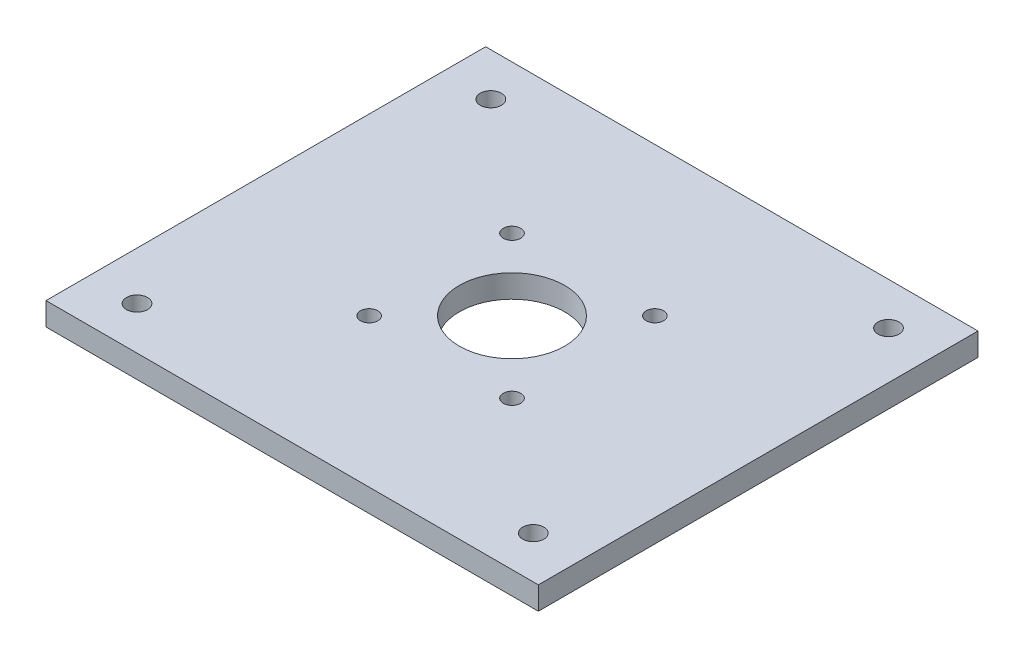
ISO-10303-21;
HEADER;
FILE_DESCRIPTION(('STEP AP214'),'2;1');
FILE_NAME('part.step','',(''),(''),'','','');
FILE_SCHEMA(('AUTOMOTIVE_DESIGN { 1 0 10303 214 1 1 1 1 }'));
ENDSEC;
DATA;
#1=APPLICATION_CONTEXT('core data for automotive mechanical design processes');
#2=APPLICATION_PROTOCOL_DEFINITION('international standard','automotive_design',2000,#1);
#3=PRODUCT_CONTEXT('',#1,'mechanical');
#4=PRODUCT('Part','Part','',(#3));
#5=PRODUCT_RELATED_PRODUCT_CATEGORY('part','',(#4));
#6=PRODUCT_DEFINITION_FORMATION('','',#4);
#7=PRODUCT_DEFINITION_CONTEXT('part definition',#1,'design');
#8=PRODUCT_DEFINITION('design','',#6,#7);
#9=PRODUCT_DEFINITION_SHAPE('','',#8);
#10=(LENGTH_UNIT() NAMED_UNIT(*) SI_UNIT(.MILLI.,.METRE.));
#11=(NAMED_UNIT(*) PLANE_ANGLE_UNIT() SI_UNIT($,.RADIAN.));
#12=(NAMED_UNIT(*) SI_UNIT($,.STERADIAN.) SOLID_ANGLE_UNIT());
#13=UNCERTAINTY_MEASURE_WITH_UNIT(LENGTH_MEASURE(1.E-05),#10,'distance_accuracy_value','');
#14=(GEOMETRIC_REPRESENTATION_CONTEXT(3) GLOBAL_UNCERTAINTY_ASSIGNED_CONTEXT((#13)) GLOBAL_UNIT_ASSIGNED_CONTEXT((#10,
#11,#12)) REPRESENTATION_CONTEXT('',''));
#15=CARTESIAN_POINT('',(0.,0.,0.));
#16=DIRECTION('',(0.,0.,1.));
#17=DIRECTION('',(1.,0.,0.));
#18=AXIS2_PLACEMENT_3D('',#15,#16,#17);
#19=CARTESIAN_POINT('',(-53.75,5.,48.));
#20=DIRECTION('',(0.,0.,-1.));
#21=DIRECTION('',(-1.,0.,0.));
#22=AXIS2_PLACEMENT_3D('',#19,#20,#21);
#23=PLANE('',#22);
#24=DIRECTION('',(1.,0.,0.));
#25=VECTOR('',#24,1.);
#26=CARTESIAN_POINT('',(-53.75,0.,48.));
#27=LINE('',#26,#25);
#28=CARTESIAN_POINT('',(-53.75,0.,48.));
#29=VERTEX_POINT('',#28);
#30=CARTESIAN_POINT('',(53.75,0.,48.));
#31=VERTEX_POINT('',#30);
#32=EDGE_CURVE('E95',#29,#31,#27,.T.);
#33=ORIENTED_EDGE('',*,*,#32,.T.);
#34=DIRECTION('',(0.,-1.,0.));
#35=VECTOR('',#34,1.);
#36=CARTESIAN_POINT('',(53.75,5.,48.));
#37=LINE('',#36,#35);
#38=CARTESIAN_POINT('',(53.75,5.,48.));
#39=VERTEX_POINT('',#38);
#40=EDGE_CURVE('E11',#39,#31,#37,.T.);
#41=ORIENTED_EDGE('',*,*,#40,.F.);
#42=DIRECTION('',(1.,0.,0.));
#43=VECTOR('',#42,1.);
#44=CARTESIAN_POINT('',(-53.75,5.,48.));
#45=LINE('',#44,#43);
#46=CARTESIAN_POINT('',(-53.75,5.,48.));
#47=VERTEX_POINT('',#46);
#48=EDGE_CURVE('E81',#47,#39,#45,.T.);
#49=ORIENTED_EDGE('',*,*,#48,.F.);
#50=DIRECTION('',(0.,-1.,0.));
#51=VECTOR('',#50,1.);
#52=CARTESIAN_POINT('',(-53.75,5.,48.));
#53=LINE('',#52,#51);
#54=EDGE_CURVE('E48',#47,#29,#53,.T.);
#55=ORIENTED_EDGE('',*,*,#54,.T.);
#56=EDGE_LOOP('',(#33,#41,#49,#55));
#57=FACE_BOUND('',#56,.T.);
#58=ADVANCED_FACE('F32',(#57),#23,.F.);
#59=CARTESIAN_POINT('',(53.75,5.,48.));
#60=DIRECTION('',(-1.,0.,0.));
#61=DIRECTION('',(0.,0.,1.));
#62=AXIS2_PLACEMENT_3D('',#59,#60,#61);
#63=PLANE('',#62);
#64=DIRECTION('',(0.,0.,-1.));
#65=VECTOR('',#64,1.);
#66=CARTESIAN_POINT('',(53.75,0.,48.));
#67=LINE('',#66,#65);
#68=CARTESIAN_POINT('',(53.75,0.,-48.));
#69=VERTEX_POINT('',#68);
#70=EDGE_CURVE('E86',#31,#69,#67,.T.);
#71=ORIENTED_EDGE('',*,*,#70,.T.);
#72=DIRECTION('',(0.,-1.,0.));
#73=VECTOR('',#72,1.);
#74=CARTESIAN_POINT('',(53.75,5.,-48.));
#75=LINE('',#74,#73);
#76=CARTESIAN_POINT('',(53.75,5.,-48.));
#77=VERTEX_POINT('',#76);
#78=EDGE_CURVE('E40',#77,#69,#75,.T.);
#79=ORIENTED_EDGE('',*,*,#78,.F.);
#80=DIRECTION('',(0.,0.,-1.));
#81=VECTOR('',#80,1.);
#82=CARTESIAN_POINT('',(53.75,5.,48.));
#83=LINE('',#82,#81);
#84=EDGE_CURVE('E73',#39,#77,#83,.T.);
#85=ORIENTED_EDGE('',*,*,#84,.F.);
#86=ORIENTED_EDGE('',*,*,#40,.T.);
#87=EDGE_LOOP('',(#71,#79,#85,#86));
#88=FACE_BOUND('',#87,.T.);
#89=ADVANCED_FACE('F85',(#88),#63,.F.);
#90=CARTESIAN_POINT('',(-53.75,5.,-48.));
#91=DIRECTION('',(0.,0.,-1.));
#92=DIRECTION('',(-1.,0.,0.));
#93=AXIS2_PLACEMENT_3D('',#90,#91,#92);
#94=PLANE('',#93);
#95=DIRECTION('',(1.,0.,0.));
#96=VECTOR('',#95,1.);
#97=CARTESIAN_POINT('',(-53.75,0.,-48.));
#98=LINE('',#97,#96);
#99=CARTESIAN_POINT('',(-53.75,0.,-48.));
#100=VERTEX_POINT('',#99);
#101=EDGE_CURVE('E99',#100,#69,#98,.T.);
#102=ORIENTED_EDGE('',*,*,#101,.F.);
#103=DIRECTION('',(0.,-1.,0.));
#104=VECTOR('',#103,1.);
#105=CARTESIAN_POINT('',(-53.75,5.,-48.));
#106=LINE('',#105,#104);
#107=CARTESIAN_POINT('',(-53.75,5.,-48.));
#108=VERTEX_POINT('',#107);
#109=EDGE_CURVE('E62',#108,#100,#106,.T.);
#110=ORIENTED_EDGE('',*,*,#109,.F.);
#111=DIRECTION('',(1.,0.,0.));
#112=VECTOR('',#111,1.);
#113=CARTESIAN_POINT('',(-53.75,5.,-48.));
#114=LINE('',#113,#112);
#115=EDGE_CURVE('E80',#108,#77,#114,.T.);
#116=ORIENTED_EDGE('',*,*,#115,.T.);
#117=ORIENTED_EDGE('',*,*,#78,.T.);
#118=EDGE_LOOP('',(#102,#110,#116,#117));
#119=FACE_BOUND('',#118,.T.);
#120=ADVANCED_FACE('F89',(#119),#94,.T.);
#121=CARTESIAN_POINT('',(-53.75,5.,48.));
#122=DIRECTION('',(-1.,0.,0.));
#123=DIRECTION('',(0.,0.,1.));
#124=AXIS2_PLACEMENT_3D('',#121,#122,#123);
#125=PLANE('',#124);
#126=DIRECTION('',(0.,0.,-1.));
#127=VECTOR('',#126,1.);
#128=CARTESIAN_POINT('',(-53.75,0.,48.));
#129=LINE('',#128,#127);
#130=EDGE_CURVE('E101',#29,#100,#129,.T.);
#131=ORIENTED_EDGE('',*,*,#130,.F.);
#132=ORIENTED_EDGE('',*,*,#54,.F.);
#133=DIRECTION('',(0.,0.,-1.));
#134=VECTOR('',#133,1.);
#135=CARTESIAN_POINT('',(-53.75,5.,48.));
#136=LINE('',#135,#134);
#137=EDGE_CURVE('E90',#47,#108,#136,.T.);
#138=ORIENTED_EDGE('',*,*,#137,.T.);
#139=ORIENTED_EDGE('',*,*,#109,.T.);
#140=EDGE_LOOP('',(#131,#132,#138,#139));
#141=FACE_BOUND('',#140,.T.);
#142=ADVANCED_FACE('F167',(#141),#125,.T.);
#143=CARTESIAN_POINT('',(0.,5.,0.));
#144=DIRECTION('',(0.,1.,0.));
#145=DIRECTION('',(0.,0.,1.));
#146=AXIS2_PLACEMENT_3D('',#143,#144,#145);
#147=PLANE('',#146);
#148=CARTESIAN_POINT('',(-15.6,5.,-15.6));
#149=DIRECTION('',(0.,1.,0.));
#150=DIRECTION('',(0.,0.,1.));
#151=AXIS2_PLACEMENT_3D('',#148,#149,#150);
#152=CIRCLE('',#151,1.9);
#153=CARTESIAN_POINT('',(-15.6,5.,-13.7));
#154=VERTEX_POINT('',#153);
#155=EDGE_CURVE('E110',#154,#154,#152,.T.);
#156=ORIENTED_EDGE('',*,*,#155,.F.);
#157=EDGE_LOOP('',(#156));
#158=FACE_BOUND('',#157,.T.);
#159=CARTESIAN_POINT('',(15.6,5.,-15.6));
#160=DIRECTION('',(0.,1.,0.));
#161=DIRECTION('',(0.,0.,1.));
#162=AXIS2_PLACEMENT_3D('',#159,#160,#161);
#163=CIRCLE('',#162,1.9);
#164=CARTESIAN_POINT('',(15.6,5.,-13.7));
#165=VERTEX_POINT('',#164);
#166=EDGE_CURVE('E129',#165,#165,#163,.T.);
#167=ORIENTED_EDGE('',*,*,#166,.F.);
#168=EDGE_LOOP('',(#167));
#169=FACE_BOUND('',#168,.T.);
#170=CARTESIAN_POINT('',(15.6,5.,15.6));
#171=DIRECTION('',(0.,1.,0.));
#172=DIRECTION('',(0.,0.,1.));
#173=AXIS2_PLACEMENT_3D('',#170,#171,#172);
#174=CIRCLE('',#173,1.9);
#175=CARTESIAN_POINT('',(15.6,5.,17.5));
#176=VERTEX_POINT('',#175);
#177=EDGE_CURVE('E123',#176,#176,#174,.T.);
#178=ORIENTED_EDGE('',*,*,#177,.F.);
#179=EDGE_LOOP('',(#178));
#180=FACE_BOUND('',#179,.T.);
#181=CARTESIAN_POINT('',(-15.6,5.,15.6));
#182=DIRECTION('',(0.,1.,0.));
#183=DIRECTION('',(0.,0.,1.));
#184=AXIS2_PLACEMENT_3D('',#181,#182,#183);
#185=CIRCLE('',#184,1.9);
#186=CARTESIAN_POINT('',(-15.6,5.,17.5));
#187=VERTEX_POINT('',#186);
#188=EDGE_CURVE('E116',#187,#187,#185,.T.);
#189=ORIENTED_EDGE('',*,*,#188,.F.);
#190=EDGE_LOOP('',(#189));
#191=FACE_BOUND('',#190,.T.);
#192=CARTESIAN_POINT('',(43.4257465395564,5.,38.7802015609061));
#193=DIRECTION('',(0.,1.,0.));
#194=DIRECTION('',(0.,0.,1.));
#195=AXIS2_PLACEMENT_3D('',#192,#193,#194);
#196=CIRCLE('',#195,2.30000000000001);
#197=CARTESIAN_POINT('',(43.4257465395564,5.,41.0802015609061));
#198=VERTEX_POINT('',#197);
#199=EDGE_CURVE('E152',#198,#198,#196,.T.);
#200=ORIENTED_EDGE('',*,*,#199,.F.);
#201=EDGE_LOOP('',(#200));
#202=FACE_BOUND('',#201,.T.);
#203=CARTESIAN_POINT('',(-43.2555232124605,5.,-38.6281881711275));
#204=DIRECTION('',(0.,1.,0.));
#205=DIRECTION('',(0.,0.,1.));
#206=AXIS2_PLACEMENT_3D('',#203,#204,#205);
#207=CIRCLE('',#206,2.3);
#208=CARTESIAN_POINT('',(-43.2555232124605,5.,-36.3281881711275));
#209=VERTEX_POINT('',#208);
#210=EDGE_CURVE('E141',#209,#209,#207,.T.);
#211=ORIENTED_EDGE('',*,*,#210,.F.);
#212=EDGE_LOOP('',(#211));
#213=FACE_BOUND('',#212,.T.);
#214=CARTESIAN_POINT('',(43.4257465395564,5.,-38.7802015609061));
#215=DIRECTION('',(0.,1.,0.));
#216=DIRECTION('',(0.,0.,1.));
#217=AXIS2_PLACEMENT_3D('',#214,#215,#216);
#218=CIRCLE('',#217,2.30000000000001);
#219=CARTESIAN_POINT('',(43.4257465395564,5.,-36.4802015609061));
#220=VERTEX_POINT('',#219);
#221=EDGE_CURVE('E140',#220,#220,#218,.T.);
#222=ORIENTED_EDGE('',*,*,#221,.F.);
#223=EDGE_LOOP('',(#222));
#224=FACE_BOUND('',#223,.T.);
#225=CARTESIAN_POINT('',(0.,5.,0.));
#226=DIRECTION('',(0.,1.,0.));
#227=DIRECTION('',(0.,0.,1.));
#228=AXIS2_PLACEMENT_3D('',#225,#226,#227);
#229=CIRCLE('',#228,11.5);
#230=CARTESIAN_POINT('',(0.,5.,11.5));
#231=VERTEX_POINT('',#230);
#232=EDGE_CURVE('E117',#231,#231,#229,.T.);
#233=ORIENTED_EDGE('',*,*,#232,.F.);
#234=EDGE_LOOP('',(#233));
#235=FACE_BOUND('',#234,.T.);
#236=CARTESIAN_POINT('',(-43.2555232124605,5.,38.6281881711275));
#237=DIRECTION('',(0.,1.,0.));
#238=DIRECTION('',(0.,0.,1.));
#239=AXIS2_PLACEMENT_3D('',#236,#237,#238);
#240=CIRCLE('',#239,2.3);
#241=CARTESIAN_POINT('',(-43.2555232124605,5.,40.9281881711275));
#242=VERTEX_POINT('',#241);
#243=EDGE_CURVE('E97',#242,#242,#240,.T.);
#244=ORIENTED_EDGE('',*,*,#243,.F.);
#245=EDGE_LOOP('',(#244));
#246=FACE_BOUND('',#245,.T.);
#247=ORIENTED_EDGE('',*,*,#48,.T.);
#248=ORIENTED_EDGE('',*,*,#84,.T.);
#249=ORIENTED_EDGE('',*,*,#115,.F.);
#250=ORIENTED_EDGE('',*,*,#137,.F.);
#251=EDGE_LOOP('',(#247,#248,#249,#250));
#252=FACE_BOUND('',#251,.T.);
#253=ADVANCED_FACE('F77',(#158,#169,#180,#191,#202,#213,#224,#235,#246,#252),#147,.T.);
#254=CARTESIAN_POINT('',(0.,0.,0.));
#255=DIRECTION('',(0.,1.,0.));
#256=DIRECTION('',(0.,0.,1.));
#257=AXIS2_PLACEMENT_3D('',#254,#255,#256);
#258=PLANE('',#257);
#259=CARTESIAN_POINT('',(-15.6,0.,-15.6));
#260=DIRECTION('',(0.,1.,0.));
#261=DIRECTION('',(0.,0.,1.));
#262=AXIS2_PLACEMENT_3D('',#259,#260,#261);
#263=CIRCLE('',#262,1.9);
#264=CARTESIAN_POINT('',(-15.6,0.,-13.7));
#265=VERTEX_POINT('',#264);
#266=EDGE_CURVE('E132',#265,#265,#263,.T.);
#267=ORIENTED_EDGE('',*,*,#266,.T.);
#268=EDGE_LOOP('',(#267));
#269=FACE_BOUND('',#268,.T.);
#270=CARTESIAN_POINT('',(15.6,0.,-15.6));
#271=DIRECTION('',(0.,1.,0.));
#272=DIRECTION('',(0.,0.,1.));
#273=AXIS2_PLACEMENT_3D('',#270,#271,#272);
#274=CIRCLE('',#273,1.9);
#275=CARTESIAN_POINT('',(15.6,0.,-13.7));
#276=VERTEX_POINT('',#275);
#277=EDGE_CURVE('E126',#276,#276,#274,.T.);
#278=ORIENTED_EDGE('',*,*,#277,.T.);
#279=EDGE_LOOP('',(#278));
#280=FACE_BOUND('',#279,.T.);
#281=CARTESIAN_POINT('',(15.6,0.,15.6));
#282=DIRECTION('',(0.,1.,0.));
#283=DIRECTION('',(0.,0.,1.));
#284=AXIS2_PLACEMENT_3D('',#281,#282,#283);
#285=CIRCLE('',#284,1.9);
#286=CARTESIAN_POINT('',(15.6,0.,17.5));
#287=VERTEX_POINT('',#286);
#288=EDGE_CURVE('E120',#287,#287,#285,.T.);
#289=ORIENTED_EDGE('',*,*,#288,.T.);
#290=EDGE_LOOP('',(#289));
#291=FACE_BOUND('',#290,.T.);
#292=CARTESIAN_POINT('',(-15.6,0.,15.6));
#293=DIRECTION('',(0.,1.,0.));
#294=DIRECTION('',(0.,0.,1.));
#295=AXIS2_PLACEMENT_3D('',#292,#293,#294);
#296=CIRCLE('',#295,1.9);
#297=CARTESIAN_POINT('',(-15.6,0.,17.5));
#298=VERTEX_POINT('',#297);
#299=EDGE_CURVE('E113',#298,#298,#296,.T.);
#300=ORIENTED_EDGE('',*,*,#299,.T.);
#301=EDGE_LOOP('',(#300));
#302=FACE_BOUND('',#301,.T.);
#303=CARTESIAN_POINT('',(43.4257465395564,0.,38.7802015609061));
#304=DIRECTION('',(0.,1.,0.));
#305=DIRECTION('',(0.,0.,1.));
#306=AXIS2_PLACEMENT_3D('',#303,#304,#305);
#307=CIRCLE('',#306,2.30000000000001);
#308=CARTESIAN_POINT('',(43.4257465395564,0.,41.0802015609061));
#309=VERTEX_POINT('',#308);
#310=EDGE_CURVE('E149',#309,#309,#307,.T.);
#311=ORIENTED_EDGE('',*,*,#310,.T.);
#312=EDGE_LOOP('',(#311));
#313=FACE_BOUND('',#312,.T.);
#314=CARTESIAN_POINT('',(-43.2555232124605,0.,-38.6281881711275));
#315=DIRECTION('',(0.,1.,0.));
#316=DIRECTION('',(0.,0.,1.));
#317=AXIS2_PLACEMENT_3D('',#314,#315,#316);
#318=CIRCLE('',#317,2.3);
#319=CARTESIAN_POINT('',(-43.2555232124605,0.,-36.3281881711275));
#320=VERTEX_POINT('',#319);
#321=EDGE_CURVE('E155',#320,#320,#318,.T.);
#322=ORIENTED_EDGE('',*,*,#321,.T.);
#323=EDGE_LOOP('',(#322));
#324=FACE_BOUND('',#323,.T.);
#325=CARTESIAN_POINT('',(43.4257465395564,0.,-38.7802015609061));
#326=DIRECTION('',(0.,1.,0.));
#327=DIRECTION('',(0.,0.,1.));
#328=AXIS2_PLACEMENT_3D('',#325,#326,#327);
#329=CIRCLE('',#328,2.30000000000001);
#330=CARTESIAN_POINT('',(43.4257465395564,0.,-36.4802015609061));
#331=VERTEX_POINT('',#330);
#332=EDGE_CURVE('E137',#331,#331,#329,.T.);
#333=ORIENTED_EDGE('',*,*,#332,.T.);
#334=EDGE_LOOP('',(#333));
#335=FACE_BOUND('',#334,.T.);
#336=CARTESIAN_POINT('',(0.,0.,0.));
#337=DIRECTION('',(0.,1.,0.));
#338=DIRECTION('',(0.,0.,1.));
#339=AXIS2_PLACEMENT_3D('',#336,#337,#338);
#340=CIRCLE('',#339,11.5);
#341=CARTESIAN_POINT('',(0.,0.,11.5));
#342=VERTEX_POINT('',#341);
#343=EDGE_CURVE('E144',#342,#342,#340,.T.);
#344=ORIENTED_EDGE('',*,*,#343,.T.);
#345=EDGE_LOOP('',(#344));
#346=FACE_BOUND('',#345,.T.);
#347=CARTESIAN_POINT('',(-43.2555232124605,0.,38.6281881711275));
#348=DIRECTION('',(0.,1.,0.));
#349=DIRECTION('',(0.,0.,1.));
#350=AXIS2_PLACEMENT_3D('',#347,#348,#349);
#351=CIRCLE('',#350,2.3);
#352=CARTESIAN_POINT('',(-43.2555232124605,0.,40.9281881711275));
#353=VERTEX_POINT('',#352);
#354=EDGE_CURVE('E107',#353,#353,#351,.T.);
#355=ORIENTED_EDGE('',*,*,#354,.T.);
#356=EDGE_LOOP('',(#355));
#357=FACE_BOUND('',#356,.T.);
#358=ORIENTED_EDGE('',*,*,#32,.F.);
#359=ORIENTED_EDGE('',*,*,#130,.T.);
#360=ORIENTED_EDGE('',*,*,#101,.T.);
#361=ORIENTED_EDGE('',*,*,#70,.F.);
#362=EDGE_LOOP('',(#358,#359,#360,#361));
#363=FACE_BOUND('',#362,.T.);
#364=ADVANCED_FACE('F166',(#269,#280,#291,#302,#313,#324,#335,#346,#357,#363),#258,.F.);
#365=CARTESIAN_POINT('',(-43.2555232124605,5.,38.6281881711275));
#366=DIRECTION('',(0.,-1.,0.));
#367=DIRECTION('',(0.,0.,-1.));
#368=AXIS2_PLACEMENT_3D('',#365,#366,#367);
#369=CYLINDRICAL_SURFACE('',#368,2.3);
#370=ORIENTED_EDGE('',*,*,#243,.T.);
#371=EDGE_LOOP('',(#370));
#372=FACE_BOUND('',#371,.T.);
#373=ORIENTED_EDGE('',*,*,#354,.F.);
#374=EDGE_LOOP('',(#373));
#375=FACE_BOUND('',#374,.T.);
#376=ADVANCED_FACE('F176',(#372,#375),#369,.F.);
#377=CARTESIAN_POINT('',(0.,5.,0.));
#378=DIRECTION('',(0.,-1.,0.));
#379=DIRECTION('',(0.,0.,-1.));
#380=AXIS2_PLACEMENT_3D('',#377,#378,#379);
#381=CYLINDRICAL_SURFACE('',#380,11.5);
#382=ORIENTED_EDGE('',*,*,#232,.T.);
#383=EDGE_LOOP('',(#382));
#384=FACE_BOUND('',#383,.T.);
#385=ORIENTED_EDGE('',*,*,#343,.F.);
#386=EDGE_LOOP('',(#385));
#387=FACE_BOUND('',#386,.T.);
#388=ADVANCED_FACE('F179',(#384,#387),#381,.F.);
#389=CARTESIAN_POINT('',(43.4257465395564,5.,-38.7802015609061));
#390=DIRECTION('',(0.,-1.,0.));
#391=DIRECTION('',(0.,0.,-1.));
#392=AXIS2_PLACEMENT_3D('',#389,#390,#391);
#393=CYLINDRICAL_SURFACE('',#392,2.30000000000001);
#394=ORIENTED_EDGE('',*,*,#221,.T.);
#395=EDGE_LOOP('',(#394));
#396=FACE_BOUND('',#395,.T.);
#397=ORIENTED_EDGE('',*,*,#332,.F.);
#398=EDGE_LOOP('',(#397));
#399=FACE_BOUND('',#398,.T.);
#400=ADVANCED_FACE('F233',(#396,#399),#393,.F.);
#401=CARTESIAN_POINT('',(-43.2555232124605,5.,-38.6281881711275));
#402=DIRECTION('',(0.,-1.,0.));
#403=DIRECTION('',(0.,0.,-1.));
#404=AXIS2_PLACEMENT_3D('',#401,#402,#403);
#405=CYLINDRICAL_SURFACE('',#404,2.3);
#406=ORIENTED_EDGE('',*,*,#210,.T.);
#407=EDGE_LOOP('',(#406));
#408=FACE_BOUND('',#407,.T.);
#409=ORIENTED_EDGE('',*,*,#321,.F.);
#410=EDGE_LOOP('',(#409));
#411=FACE_BOUND('',#410,.T.);
#412=ADVANCED_FACE('F161',(#408,#411),#405,.F.);
#413=CARTESIAN_POINT('',(43.4257465395564,5.,38.7802015609061));
#414=DIRECTION('',(0.,-1.,0.));
#415=DIRECTION('',(0.,0.,-1.));
#416=AXIS2_PLACEMENT_3D('',#413,#414,#415);
#417=CYLINDRICAL_SURFACE('',#416,2.30000000000001);
#418=ORIENTED_EDGE('',*,*,#199,.T.);
#419=EDGE_LOOP('',(#418));
#420=FACE_BOUND('',#419,.T.);
#421=ORIENTED_EDGE('',*,*,#310,.F.);
#422=EDGE_LOOP('',(#421));
#423=FACE_BOUND('',#422,.T.);
#424=ADVANCED_FACE('F252',(#420,#423),#417,.F.);
#425=CARTESIAN_POINT('',(-15.6,5.,15.6));
#426=DIRECTION('',(0.,-1.,0.));
#427=DIRECTION('',(0.,0.,-1.));
#428=AXIS2_PLACEMENT_3D('',#425,#426,#427);
#429=CYLINDRICAL_SURFACE('',#428,1.9);
#430=ORIENTED_EDGE('',*,*,#188,.T.);
#431=EDGE_LOOP('',(#430));
#432=FACE_BOUND('',#431,.T.);
#433=ORIENTED_EDGE('',*,*,#299,.F.);
#434=EDGE_LOOP('',(#433));
#435=FACE_BOUND('',#434,.T.);
#436=ADVANCED_FACE('F261',(#432,#435),#429,.F.);
#437=CARTESIAN_POINT('',(15.6,5.,15.6));
#438=DIRECTION('',(0.,-1.,0.));
#439=DIRECTION('',(0.,0.,-1.));
#440=AXIS2_PLACEMENT_3D('',#437,#438,#439);
#441=CYLINDRICAL_SURFACE('',#440,1.9);
#442=ORIENTED_EDGE('',*,*,#177,.T.);
#443=EDGE_LOOP('',(#442));
#444=FACE_BOUND('',#443,.T.);
#445=ORIENTED_EDGE('',*,*,#288,.F.);
#446=EDGE_LOOP('',(#445));
#447=FACE_BOUND('',#446,.T.);
#448=ADVANCED_FACE('F271',(#444,#447),#441,.F.);
#449=CARTESIAN_POINT('',(15.6,5.,-15.6));
#450=DIRECTION('',(0.,-1.,0.));
#451=DIRECTION('',(0.,0.,-1.));
#452=AXIS2_PLACEMENT_3D('',#449,#450,#451);
#453=CYLINDRICAL_SURFACE('',#452,1.9);
#454=ORIENTED_EDGE('',*,*,#166,.T.);
#455=EDGE_LOOP('',(#454));
#456=FACE_BOUND('',#455,.T.);
#457=ORIENTED_EDGE('',*,*,#277,.F.);
#458=EDGE_LOOP('',(#457));
#459=FACE_BOUND('',#458,.T.);
#460=ADVANCED_FACE('F281',(#456,#459),#453,.F.);
#461=CARTESIAN_POINT('',(-15.6,5.,-15.6));
#462=DIRECTION('',(0.,-1.,0.));
#463=DIRECTION('',(0.,0.,-1.));
#464=AXIS2_PLACEMENT_3D('',#461,#462,#463);
#465=CYLINDRICAL_SURFACE('',#464,1.9);
#466=ORIENTED_EDGE('',*,*,#155,.T.);
#467=EDGE_LOOP('',(#466));
#468=FACE_BOUND('',#467,.T.);
#469=ORIENTED_EDGE('',*,*,#266,.F.);
#470=EDGE_LOOP('',(#469));
#471=FACE_BOUND('',#470,.T.);
#472=ADVANCED_FACE('F291',(#468,#471),#465,.F.);
#473=CLOSED_SHELL('',(#58,#89,#120,#142,#253,#364,#376,#388,#400,#412,#424,#436,#448,#460,#472));
#474=MANIFOLD_SOLID_BREP('B2',#473);
#475=ADVANCED_BREP_SHAPE_REPRESENTATION('',(#18,#474),#14);
#476=SHAPE_DEFINITION_REPRESENTATION(#9,#475);
ENDSEC;
END-ISO-10303-21;
